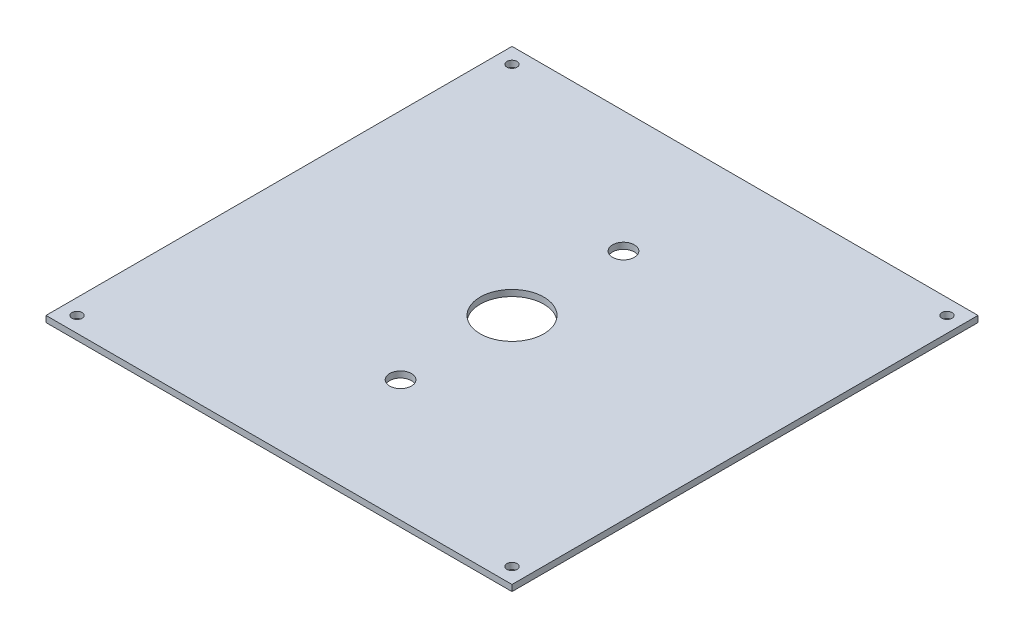
ISO-10303-21;
HEADER;
FILE_DESCRIPTION(('STEP AP214'),'2;1');
FILE_NAME('part.step','',(''),(''),'','','');
FILE_SCHEMA(('AUTOMOTIVE_DESIGN { 1 0 10303 214 1 1 1 1 }'));
ENDSEC;
DATA;
#1=APPLICATION_CONTEXT('core data for automotive mechanical design processes');
#2=APPLICATION_PROTOCOL_DEFINITION('international standard','automotive_design',2000,#1);
#3=PRODUCT_CONTEXT('',#1,'mechanical');
#4=PRODUCT('Part','Part','',(#3));
#5=PRODUCT_RELATED_PRODUCT_CATEGORY('part','',(#4));
#6=PRODUCT_DEFINITION_FORMATION('','',#4);
#7=PRODUCT_DEFINITION_CONTEXT('part definition',#1,'design');
#8=PRODUCT_DEFINITION('design','',#6,#7);
#9=PRODUCT_DEFINITION_SHAPE('','',#8);
#10=(LENGTH_UNIT() NAMED_UNIT(*) SI_UNIT(.MILLI.,.METRE.));
#11=(NAMED_UNIT(*) PLANE_ANGLE_UNIT() SI_UNIT($,.RADIAN.));
#12=(NAMED_UNIT(*) SI_UNIT($,.STERADIAN.) SOLID_ANGLE_UNIT());
#13=UNCERTAINTY_MEASURE_WITH_UNIT(LENGTH_MEASURE(1.E-05),#10,'distance_accuracy_value','');
#14=(GEOMETRIC_REPRESENTATION_CONTEXT(3) GLOBAL_UNCERTAINTY_ASSIGNED_CONTEXT((#13)) GLOBAL_UNIT_ASSIGNED_CONTEXT((#10,
#11,#12)) REPRESENTATION_CONTEXT('',''));
#15=CARTESIAN_POINT('',(0.,0.,0.));
#16=DIRECTION('',(0.,0.,1.));
#17=DIRECTION('',(1.,0.,0.));
#18=AXIS2_PLACEMENT_3D('',#15,#16,#17);
#19=CARTESIAN_POINT('',(-150.,4.,-150.));
#20=DIRECTION('',(1.,0.,0.));
#21=DIRECTION('',(0.,0.,-1.));
#22=AXIS2_PLACEMENT_3D('',#19,#20,#21);
#23=PLANE('',#22);
#24=DIRECTION('',(0.,0.,1.));
#25=VECTOR('',#24,1.);
#26=CARTESIAN_POINT('',(-150.,0.,-150.));
#27=LINE('',#26,#25);
#28=CARTESIAN_POINT('',(-150.,0.,-150.));
#29=VERTEX_POINT('',#28);
#30=CARTESIAN_POINT('',(-150.,0.,150.));
#31=VERTEX_POINT('',#30);
#32=EDGE_CURVE('E96',#29,#31,#27,.T.);
#33=ORIENTED_EDGE('',*,*,#32,.T.);
#34=DIRECTION('',(0.,-1.,0.));
#35=VECTOR('',#34,1.);
#36=CARTESIAN_POINT('',(-150.,4.,150.));
#37=LINE('',#36,#35);
#38=CARTESIAN_POINT('',(-150.,4.,150.));
#39=VERTEX_POINT('',#38);
#40=EDGE_CURVE('E11',#39,#31,#37,.T.);
#41=ORIENTED_EDGE('',*,*,#40,.F.);
#42=DIRECTION('',(0.,0.,1.));
#43=VECTOR('',#42,1.);
#44=CARTESIAN_POINT('',(-150.,4.,-150.));
#45=LINE('',#44,#43);
#46=CARTESIAN_POINT('',(-150.,4.,-150.));
#47=VERTEX_POINT('',#46);
#48=EDGE_CURVE('E84',#47,#39,#45,.T.);
#49=ORIENTED_EDGE('',*,*,#48,.F.);
#50=DIRECTION('',(0.,-1.,0.));
#51=VECTOR('',#50,1.);
#52=CARTESIAN_POINT('',(-150.,4.,-150.));
#53=LINE('',#52,#51);
#54=EDGE_CURVE('E92',#47,#29,#53,.T.);
#55=ORIENTED_EDGE('',*,*,#54,.T.);
#56=EDGE_LOOP('',(#33,#41,#49,#55));
#57=FACE_BOUND('',#56,.T.);
#58=ADVANCED_FACE('F33',(#57),#23,.F.);
#59=CARTESIAN_POINT('',(150.,4.,150.));
#60=DIRECTION('',(0.,0.,-1.));
#61=DIRECTION('',(-1.,0.,0.));
#62=AXIS2_PLACEMENT_3D('',#59,#60,#61);
#63=PLANE('',#62);
#64=DIRECTION('',(1.,0.,0.));
#65=VECTOR('',#64,1.);
#66=CARTESIAN_POINT('',(150.,0.,150.));
#67=LINE('',#66,#65);
#68=CARTESIAN_POINT('',(150.,0.,150.));
#69=VERTEX_POINT('',#68);
#70=EDGE_CURVE('E88',#31,#69,#67,.T.);
#71=ORIENTED_EDGE('',*,*,#70,.T.);
#72=DIRECTION('',(0.,-1.,0.));
#73=VECTOR('',#72,1.);
#74=CARTESIAN_POINT('',(150.,4.,150.));
#75=LINE('',#74,#73);
#76=CARTESIAN_POINT('',(150.,4.,150.));
#77=VERTEX_POINT('',#76);
#78=EDGE_CURVE('E41',#77,#69,#75,.T.);
#79=ORIENTED_EDGE('',*,*,#78,.F.);
#80=DIRECTION('',(1.,0.,0.));
#81=VECTOR('',#80,1.);
#82=CARTESIAN_POINT('',(150.,4.,150.));
#83=LINE('',#82,#81);
#84=EDGE_CURVE('E79',#39,#77,#83,.T.);
#85=ORIENTED_EDGE('',*,*,#84,.F.);
#86=ORIENTED_EDGE('',*,*,#40,.T.);
#87=EDGE_LOOP('',(#71,#79,#85,#86));
#88=FACE_BOUND('',#87,.T.);
#89=ADVANCED_FACE('F87',(#88),#63,.F.);
#90=CARTESIAN_POINT('',(150.,4.,-150.));
#91=DIRECTION('',(-1.,0.,0.));
#92=DIRECTION('',(0.,0.,1.));
#93=AXIS2_PLACEMENT_3D('',#90,#91,#92);
#94=PLANE('',#93);
#95=DIRECTION('',(0.,0.,-1.));
#96=VECTOR('',#95,1.);
#97=CARTESIAN_POINT('',(150.,0.,-150.));
#98=LINE('',#97,#96);
#99=CARTESIAN_POINT('',(150.,0.,-150.));
#100=VERTEX_POINT('',#99);
#101=EDGE_CURVE('E66',#69,#100,#98,.T.);
#102=ORIENTED_EDGE('',*,*,#101,.T.);
#103=DIRECTION('',(0.,-1.,0.));
#104=VECTOR('',#103,1.);
#105=CARTESIAN_POINT('',(150.,4.,-150.));
#106=LINE('',#105,#104);
#107=CARTESIAN_POINT('',(150.,4.,-150.));
#108=VERTEX_POINT('',#107);
#109=EDGE_CURVE('E89',#108,#100,#106,.T.);
#110=ORIENTED_EDGE('',*,*,#109,.F.);
#111=DIRECTION('',(0.,0.,-1.));
#112=VECTOR('',#111,1.);
#113=CARTESIAN_POINT('',(150.,4.,-150.));
#114=LINE('',#113,#112);
#115=EDGE_CURVE('E82',#77,#108,#114,.T.);
#116=ORIENTED_EDGE('',*,*,#115,.F.);
#117=ORIENTED_EDGE('',*,*,#78,.T.);
#118=EDGE_LOOP('',(#102,#110,#116,#117));
#119=FACE_BOUND('',#118,.T.);
#120=ADVANCED_FACE('F90',(#119),#94,.F.);
#121=CARTESIAN_POINT('',(150.,4.,-150.));
#122=DIRECTION('',(0.,0.,1.));
#123=DIRECTION('',(1.,0.,0.));
#124=AXIS2_PLACEMENT_3D('',#121,#122,#123);
#125=PLANE('',#124);
#126=DIRECTION('',(-1.,0.,0.));
#127=VECTOR('',#126,1.);
#128=CARTESIAN_POINT('',(150.,0.,-150.));
#129=LINE('',#128,#127);
#130=EDGE_CURVE('E72',#100,#29,#129,.T.);
#131=ORIENTED_EDGE('',*,*,#130,.T.);
#132=ORIENTED_EDGE('',*,*,#54,.F.);
#133=DIRECTION('',(-1.,0.,0.));
#134=VECTOR('',#133,1.);
#135=CARTESIAN_POINT('',(150.,4.,-150.));
#136=LINE('',#135,#134);
#137=EDGE_CURVE('E49',#108,#47,#136,.T.);
#138=ORIENTED_EDGE('',*,*,#137,.F.);
#139=ORIENTED_EDGE('',*,*,#109,.T.);
#140=EDGE_LOOP('',(#131,#132,#138,#139));
#141=FACE_BOUND('',#140,.T.);
#142=ADVANCED_FACE('F104',(#141),#125,.F.);
#143=CARTESIAN_POINT('',(0.,4.,0.));
#144=DIRECTION('',(0.,-1.,0.));
#145=DIRECTION('',(0.,0.,-1.));
#146=AXIS2_PLACEMENT_3D('',#143,#144,#145);
#147=PLANE('',#146);
#148=CARTESIAN_POINT('',(0.,4.,71.7499999999999));
#149=DIRECTION('',(0.,1.,0.));
#150=DIRECTION('',(0.,0.,-1.));
#151=AXIS2_PLACEMENT_3D('',#148,#149,#150);
#152=CIRCLE('',#151,7.);
#153=CARTESIAN_POINT('',(0.,4.,64.7499999999999));
#154=VERTEX_POINT('',#153);
#155=EDGE_CURVE('E143',#154,#154,#152,.T.);
#156=ORIENTED_EDGE('',*,*,#155,.F.);
#157=EDGE_LOOP('',(#156));
#158=FACE_BOUND('',#157,.T.);
#159=CARTESIAN_POINT('',(0.,4.,-71.75));
#160=DIRECTION('',(0.,1.,0.));
#161=DIRECTION('',(0.,0.,1.));
#162=AXIS2_PLACEMENT_3D('',#159,#160,#161);
#163=CIRCLE('',#162,7.);
#164=CARTESIAN_POINT('',(0.,4.,-64.75));
#165=VERTEX_POINT('',#164);
#166=EDGE_CURVE('E137',#165,#165,#163,.T.);
#167=ORIENTED_EDGE('',*,*,#166,.F.);
#168=EDGE_LOOP('',(#167));
#169=FACE_BOUND('',#168,.T.);
#170=CARTESIAN_POINT('',(0.,4.,0.));
#171=DIRECTION('',(0.,1.,0.));
#172=DIRECTION('',(0.,0.,1.));
#173=AXIS2_PLACEMENT_3D('',#170,#171,#172);
#174=CIRCLE('',#173,20.5);
#175=CARTESIAN_POINT('',(0.,4.,20.5));
#176=VERTEX_POINT('',#175);
#177=EDGE_CURVE('E120',#176,#176,#174,.T.);
#178=ORIENTED_EDGE('',*,*,#177,.F.);
#179=EDGE_LOOP('',(#178));
#180=FACE_BOUND('',#179,.T.);
#181=CARTESIAN_POINT('',(140.,4.,-140.));
#182=DIRECTION('',(0.,1.,0.));
#183=DIRECTION('',(0.,0.,-1.));
#184=AXIS2_PLACEMENT_3D('',#181,#182,#183);
#185=CIRCLE('',#184,3.25000000000001);
#186=CARTESIAN_POINT('',(140.,4.,-143.25));
#187=VERTEX_POINT('',#186);
#188=EDGE_CURVE('E113',#187,#187,#185,.T.);
#189=ORIENTED_EDGE('',*,*,#188,.F.);
#190=EDGE_LOOP('',(#189));
#191=FACE_BOUND('',#190,.T.);
#192=CARTESIAN_POINT('',(140.,4.,140.));
#193=DIRECTION('',(0.,1.,0.));
#194=DIRECTION('',(0.,0.,1.));
#195=AXIS2_PLACEMENT_3D('',#192,#193,#194);
#196=CIRCLE('',#195,3.25000000000001);
#197=CARTESIAN_POINT('',(140.,4.,143.25));
#198=VERTEX_POINT('',#197);
#199=EDGE_CURVE('E126',#198,#198,#196,.T.);
#200=ORIENTED_EDGE('',*,*,#199,.F.);
#201=EDGE_LOOP('',(#200));
#202=FACE_BOUND('',#201,.T.);
#203=CARTESIAN_POINT('',(-140.,4.,140.));
#204=DIRECTION('',(0.,1.,0.));
#205=DIRECTION('',(0.,0.,-1.));
#206=AXIS2_PLACEMENT_3D('',#203,#204,#205);
#207=CIRCLE('',#206,3.25000000000001);
#208=CARTESIAN_POINT('',(-140.,4.,136.75));
#209=VERTEX_POINT('',#208);
#210=EDGE_CURVE('E119',#209,#209,#207,.T.);
#211=ORIENTED_EDGE('',*,*,#210,.F.);
#212=EDGE_LOOP('',(#211));
#213=FACE_BOUND('',#212,.T.);
#214=CARTESIAN_POINT('',(-140.,4.,-140.));
#215=DIRECTION('',(0.,1.,0.));
#216=DIRECTION('',(0.,0.,1.));
#217=AXIS2_PLACEMENT_3D('',#214,#215,#216);
#218=CIRCLE('',#217,3.25000000000001);
#219=CARTESIAN_POINT('',(-140.,4.,-136.75));
#220=VERTEX_POINT('',#219);
#221=EDGE_CURVE('E99',#220,#220,#218,.T.);
#222=ORIENTED_EDGE('',*,*,#221,.F.);
#223=EDGE_LOOP('',(#222));
#224=FACE_BOUND('',#223,.T.);
#225=ORIENTED_EDGE('',*,*,#48,.T.);
#226=ORIENTED_EDGE('',*,*,#84,.T.);
#227=ORIENTED_EDGE('',*,*,#115,.T.);
#228=ORIENTED_EDGE('',*,*,#137,.T.);
#229=EDGE_LOOP('',(#225,#226,#227,#228));
#230=FACE_BOUND('',#229,.T.);
#231=ADVANCED_FACE('F80',(#158,#169,#180,#191,#202,#213,#224,#230),#147,.F.);
#232=CARTESIAN_POINT('',(0.,0.,0.));
#233=DIRECTION('',(0.,-1.,0.));
#234=DIRECTION('',(0.,0.,-1.));
#235=AXIS2_PLACEMENT_3D('',#232,#233,#234);
#236=PLANE('',#235);
#237=CARTESIAN_POINT('',(0.,0.,71.7499999999999));
#238=DIRECTION('',(0.,-1.,0.));
#239=DIRECTION('',(0.,0.,-1.));
#240=AXIS2_PLACEMENT_3D('',#237,#238,#239);
#241=CIRCLE('',#240,7.);
#242=CARTESIAN_POINT('',(0.,0.,64.7499999999999));
#243=VERTEX_POINT('',#242);
#244=EDGE_CURVE('E146',#243,#243,#241,.F.);
#245=ORIENTED_EDGE('',*,*,#244,.T.);
#246=EDGE_LOOP('',(#245));
#247=FACE_BOUND('',#246,.T.);
#248=CARTESIAN_POINT('',(0.,0.,-71.75));
#249=DIRECTION('',(0.,-1.,0.));
#250=DIRECTION('',(0.,0.,-1.));
#251=AXIS2_PLACEMENT_3D('',#248,#249,#250);
#252=CIRCLE('',#251,7.);
#253=CARTESIAN_POINT('',(0.,0.,-78.75));
#254=VERTEX_POINT('',#253);
#255=EDGE_CURVE('E140',#254,#254,#252,.F.);
#256=ORIENTED_EDGE('',*,*,#255,.T.);
#257=EDGE_LOOP('',(#256));
#258=FACE_BOUND('',#257,.T.);
#259=CARTESIAN_POINT('',(0.,0.,0.));
#260=DIRECTION('',(0.,-1.,0.));
#261=DIRECTION('',(0.,0.,-1.));
#262=AXIS2_PLACEMENT_3D('',#259,#260,#261);
#263=CIRCLE('',#262,20.5);
#264=CARTESIAN_POINT('',(0.,0.,-20.5));
#265=VERTEX_POINT('',#264);
#266=EDGE_CURVE('E134',#265,#265,#263,.F.);
#267=ORIENTED_EDGE('',*,*,#266,.T.);
#268=EDGE_LOOP('',(#267));
#269=FACE_BOUND('',#268,.T.);
#270=CARTESIAN_POINT('',(140.,0.,-140.));
#271=DIRECTION('',(0.,-1.,0.));
#272=DIRECTION('',(0.,0.,-1.));
#273=AXIS2_PLACEMENT_3D('',#270,#271,#272);
#274=CIRCLE('',#273,3.25000000000001);
#275=CARTESIAN_POINT('',(140.,0.,-143.25));
#276=VERTEX_POINT('',#275);
#277=EDGE_CURVE('E129',#276,#276,#274,.F.);
#278=ORIENTED_EDGE('',*,*,#277,.T.);
#279=EDGE_LOOP('',(#278));
#280=FACE_BOUND('',#279,.T.);
#281=CARTESIAN_POINT('',(140.,0.,140.));
#282=DIRECTION('',(0.,-1.,0.));
#283=DIRECTION('',(0.,0.,-1.));
#284=AXIS2_PLACEMENT_3D('',#281,#282,#283);
#285=CIRCLE('',#284,3.25000000000001);
#286=CARTESIAN_POINT('',(140.,0.,136.75));
#287=VERTEX_POINT('',#286);
#288=EDGE_CURVE('E123',#287,#287,#285,.F.);
#289=ORIENTED_EDGE('',*,*,#288,.T.);
#290=EDGE_LOOP('',(#289));
#291=FACE_BOUND('',#290,.T.);
#292=CARTESIAN_POINT('',(-140.,0.,140.));
#293=DIRECTION('',(0.,-1.,0.));
#294=DIRECTION('',(0.,0.,-1.));
#295=AXIS2_PLACEMENT_3D('',#292,#293,#294);
#296=CIRCLE('',#295,3.25000000000001);
#297=CARTESIAN_POINT('',(-140.,0.,136.75));
#298=VERTEX_POINT('',#297);
#299=EDGE_CURVE('E116',#298,#298,#296,.F.);
#300=ORIENTED_EDGE('',*,*,#299,.T.);
#301=EDGE_LOOP('',(#300));
#302=FACE_BOUND('',#301,.T.);
#303=CARTESIAN_POINT('',(-140.,0.,-140.));
#304=DIRECTION('',(0.,-1.,0.));
#305=DIRECTION('',(0.,0.,-1.));
#306=AXIS2_PLACEMENT_3D('',#303,#304,#305);
#307=CIRCLE('',#306,3.25000000000001);
#308=CARTESIAN_POINT('',(-140.,0.,-143.25));
#309=VERTEX_POINT('',#308);
#310=EDGE_CURVE('E110',#309,#309,#307,.F.);
#311=ORIENTED_EDGE('',*,*,#310,.T.);
#312=EDGE_LOOP('',(#311));
#313=FACE_BOUND('',#312,.T.);
#314=ORIENTED_EDGE('',*,*,#32,.F.);
#315=ORIENTED_EDGE('',*,*,#130,.F.);
#316=ORIENTED_EDGE('',*,*,#101,.F.);
#317=ORIENTED_EDGE('',*,*,#70,.F.);
#318=EDGE_LOOP('',(#314,#315,#316,#317));
#319=FACE_BOUND('',#318,.T.);
#320=ADVANCED_FACE('F107',(#247,#258,#269,#280,#291,#302,#313,#319),#236,.T.);
#321=CARTESIAN_POINT('',(-140.,-0.00100000000000013,-140.));
#322=DIRECTION('',(0.,1.,0.));
#323=DIRECTION('',(0.,0.,1.));
#324=AXIS2_PLACEMENT_3D('',#321,#322,#323);
#325=CYLINDRICAL_SURFACE('',#324,3.25000000000001);
#326=ORIENTED_EDGE('',*,*,#310,.F.);
#327=EDGE_LOOP('',(#326));
#328=FACE_BOUND('',#327,.T.);
#329=ORIENTED_EDGE('',*,*,#221,.T.);
#330=EDGE_LOOP('',(#329));
#331=FACE_BOUND('',#330,.T.);
#332=ADVANCED_FACE('F169',(#328,#331),#325,.F.);
#333=CARTESIAN_POINT('',(-140.,-0.00100000000000013,140.));
#334=DIRECTION('',(0.,1.,0.));
#335=DIRECTION('',(0.,0.,1.));
#336=AXIS2_PLACEMENT_3D('',#333,#334,#335);
#337=CYLINDRICAL_SURFACE('',#336,3.25000000000001);
#338=ORIENTED_EDGE('',*,*,#299,.F.);
#339=EDGE_LOOP('',(#338));
#340=FACE_BOUND('',#339,.T.);
#341=ORIENTED_EDGE('',*,*,#210,.T.);
#342=EDGE_LOOP('',(#341));
#343=FACE_BOUND('',#342,.T.);
#344=ADVANCED_FACE('F171',(#340,#343),#337,.F.);
#345=CARTESIAN_POINT('',(140.,-0.00100000000000013,140.));
#346=DIRECTION('',(0.,1.,0.));
#347=DIRECTION('',(0.,0.,1.));
#348=AXIS2_PLACEMENT_3D('',#345,#346,#347);
#349=CYLINDRICAL_SURFACE('',#348,3.25000000000001);
#350=ORIENTED_EDGE('',*,*,#288,.F.);
#351=EDGE_LOOP('',(#350));
#352=FACE_BOUND('',#351,.T.);
#353=ORIENTED_EDGE('',*,*,#199,.T.);
#354=EDGE_LOOP('',(#353));
#355=FACE_BOUND('',#354,.T.);
#356=ADVANCED_FACE('F178',(#352,#355),#349,.F.);
#357=CARTESIAN_POINT('',(140.,-0.00100000000000013,-140.));
#358=DIRECTION('',(0.,1.,0.));
#359=DIRECTION('',(0.,0.,1.));
#360=AXIS2_PLACEMENT_3D('',#357,#358,#359);
#361=CYLINDRICAL_SURFACE('',#360,3.25000000000001);
#362=ORIENTED_EDGE('',*,*,#277,.F.);
#363=EDGE_LOOP('',(#362));
#364=FACE_BOUND('',#363,.T.);
#365=ORIENTED_EDGE('',*,*,#188,.T.);
#366=EDGE_LOOP('',(#365));
#367=FACE_BOUND('',#366,.T.);
#368=ADVANCED_FACE('F237',(#364,#367),#361,.F.);
#369=CARTESIAN_POINT('',(0.,-0.00100000000000013,0.));
#370=DIRECTION('',(0.,1.,0.));
#371=DIRECTION('',(0.,0.,1.));
#372=AXIS2_PLACEMENT_3D('',#369,#370,#371);
#373=CYLINDRICAL_SURFACE('',#372,20.5);
#374=ORIENTED_EDGE('',*,*,#266,.F.);
#375=EDGE_LOOP('',(#374));
#376=FACE_BOUND('',#375,.T.);
#377=ORIENTED_EDGE('',*,*,#177,.T.);
#378=EDGE_LOOP('',(#377));
#379=FACE_BOUND('',#378,.T.);
#380=ADVANCED_FACE('F218',(#376,#379),#373,.F.);
#381=CARTESIAN_POINT('',(0.,-0.00100000000000013,-71.75));
#382=DIRECTION('',(0.,1.,0.));
#383=DIRECTION('',(0.,0.,1.));
#384=AXIS2_PLACEMENT_3D('',#381,#382,#383);
#385=CYLINDRICAL_SURFACE('',#384,7.);
#386=ORIENTED_EDGE('',*,*,#255,.F.);
#387=EDGE_LOOP('',(#386));
#388=FACE_BOUND('',#387,.T.);
#389=ORIENTED_EDGE('',*,*,#166,.T.);
#390=EDGE_LOOP('',(#389));
#391=FACE_BOUND('',#390,.T.);
#392=ADVANCED_FACE('F213',(#388,#391),#385,.F.);
#393=CARTESIAN_POINT('',(0.,-0.00100000000000013,71.7499999999999));
#394=DIRECTION('',(0.,1.,0.));
#395=DIRECTION('',(0.,0.,1.));
#396=AXIS2_PLACEMENT_3D('',#393,#394,#395);
#397=CYLINDRICAL_SURFACE('',#396,7.);
#398=ORIENTED_EDGE('',*,*,#244,.F.);
#399=EDGE_LOOP('',(#398));
#400=FACE_BOUND('',#399,.T.);
#401=ORIENTED_EDGE('',*,*,#155,.T.);
#402=EDGE_LOOP('',(#401));
#403=FACE_BOUND('',#402,.T.);
#404=ADVANCED_FACE('F152',(#400,#403),#397,.F.);
#405=CLOSED_SHELL('',(#58,#89,#120,#142,#231,#320,#332,#344,#356,#368,#380,#392,#404));
#406=MANIFOLD_SOLID_BREP('B2',#405);
#407=ADVANCED_BREP_SHAPE_REPRESENTATION('',(#18,#406),#14);
#408=SHAPE_DEFINITION_REPRESENTATION(#9,#407);
ENDSEC;
END-ISO-10303-21;
